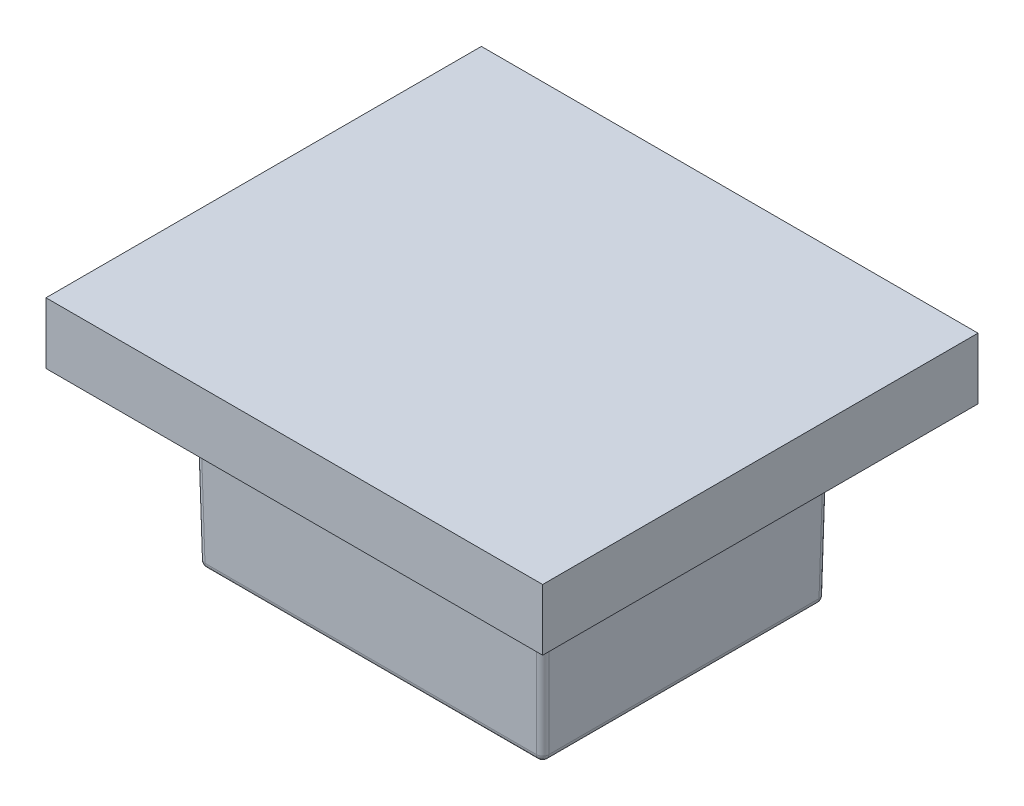
ISO-10303-21;
HEADER;
FILE_DESCRIPTION(('STEP AP214'),'2;1');
FILE_NAME('part.step','',(''),(''),'','','');
FILE_SCHEMA(('AUTOMOTIVE_DESIGN { 1 0 10303 214 1 1 1 1 }'));
ENDSEC;
DATA;
#1=APPLICATION_CONTEXT('core data for automotive mechanical design processes');
#2=APPLICATION_PROTOCOL_DEFINITION('international standard','automotive_design',2000,#1);
#3=PRODUCT_CONTEXT('',#1,'mechanical');
#4=PRODUCT('Part','Part','',(#3));
#5=PRODUCT_RELATED_PRODUCT_CATEGORY('part','',(#4));
#6=PRODUCT_DEFINITION_FORMATION('','',#4);
#7=PRODUCT_DEFINITION_CONTEXT('part definition',#1,'design');
#8=PRODUCT_DEFINITION('design','',#6,#7);
#9=PRODUCT_DEFINITION_SHAPE('','',#8);
#10=(LENGTH_UNIT() NAMED_UNIT(*) SI_UNIT(.MILLI.,.METRE.));
#11=(NAMED_UNIT(*) PLANE_ANGLE_UNIT() SI_UNIT($,.RADIAN.));
#12=(NAMED_UNIT(*) SI_UNIT($,.STERADIAN.) SOLID_ANGLE_UNIT());
#13=UNCERTAINTY_MEASURE_WITH_UNIT(LENGTH_MEASURE(1.E-05),#10,'distance_accuracy_value','');
#14=(GEOMETRIC_REPRESENTATION_CONTEXT(3) GLOBAL_UNCERTAINTY_ASSIGNED_CONTEXT((#13)) GLOBAL_UNIT_ASSIGNED_CONTEXT((#10,
#11,#12)) REPRESENTATION_CONTEXT('',''));
#15=CARTESIAN_POINT('',(0.,0.,0.));
#16=DIRECTION('',(0.,0.,1.));
#17=DIRECTION('',(1.,0.,0.));
#18=AXIS2_PLACEMENT_3D('',#15,#16,#17);
#19=CARTESIAN_POINT('',(0.,40.,0.));
#20=DIRECTION('',(0.,1.,0.));
#21=DIRECTION('',(0.,0.,1.));
#22=AXIS2_PLACEMENT_3D('',#19,#20,#21);
#23=PLANE('',#22);
#24=DIRECTION('',(0.,0.,1.));
#25=VECTOR('',#24,1.);
#26=CARTESIAN_POINT('',(70.5236519478465,40.,10.5236519478465));
#27=LINE('',#26,#25);
#28=CARTESIAN_POINT('',(70.5236519478465,40.,-60.5236519478465));
#29=VERTEX_POINT('',#28);
#30=CARTESIAN_POINT('',(70.5236519478465,40.,10.5236519478465));
#31=VERTEX_POINT('',#30);
#32=EDGE_CURVE('E225',#29,#31,#27,.T.);
#33=ORIENTED_EDGE('',*,*,#32,.F.);
#34=DIRECTION('',(1.,0.,0.));
#35=VECTOR('',#34,1.);
#36=CARTESIAN_POINT('',(70.5236519478465,40.,-60.5236519478465));
#37=LINE('',#36,#35);
#38=CARTESIAN_POINT('',(-10.5236519478465,40.,-60.5236519478465));
#39=VERTEX_POINT('',#38);
#40=EDGE_CURVE('E234',#39,#29,#37,.T.);
#41=ORIENTED_EDGE('',*,*,#40,.F.);
#42=DIRECTION('',(0.,0.,-1.));
#43=VECTOR('',#42,1.);
#44=CARTESIAN_POINT('',(-10.5236519478465,40.,10.5236519478465));
#45=LINE('',#44,#43);
#46=CARTESIAN_POINT('',(-10.5236519478465,40.,10.5236519478465));
#47=VERTEX_POINT('',#46);
#48=EDGE_CURVE('E231',#47,#39,#45,.T.);
#49=ORIENTED_EDGE('',*,*,#48,.F.);
#50=DIRECTION('',(-1.,0.,0.));
#51=VECTOR('',#50,1.);
#52=CARTESIAN_POINT('',(70.5236519478465,40.,10.5236519478465));
#53=LINE('',#52,#51);
#54=EDGE_CURVE('E228',#31,#47,#53,.T.);
#55=ORIENTED_EDGE('',*,*,#54,.F.);
#56=EDGE_LOOP('',(#33,#41,#49,#55));
#57=FACE_BOUND('',#56,.T.);
#58=ADVANCED_FACE('F41',(#57),#23,.T.);
#59=CARTESIAN_POINT('',(70.5236519478465,40.,10.5236519478465));
#60=DIRECTION('',(0.,0.,1.));
#61=DIRECTION('',(1.,0.,0.));
#62=AXIS2_PLACEMENT_3D('',#59,#60,#61);
#63=PLANE('',#62);
#64=DIRECTION('',(0.,-1.,0.));
#65=VECTOR('',#64,1.);
#66=CARTESIAN_POINT('',(-10.5236519478465,40.,10.5236519478465));
#67=LINE('',#66,#65);
#68=CARTESIAN_POINT('',(-10.5236519478465,30.,10.5236519478465));
#69=VERTEX_POINT('',#68);
#70=EDGE_CURVE('E244',#47,#69,#67,.T.);
#71=ORIENTED_EDGE('',*,*,#70,.T.);
#72=DIRECTION('',(1.,0.,0.));
#73=VECTOR('',#72,1.);
#74=CARTESIAN_POINT('',(70.5236519478465,30.,10.5236519478465));
#75=LINE('',#74,#73);
#76=CARTESIAN_POINT('',(70.5236519478465,30.,10.5236519478465));
#77=VERTEX_POINT('',#76);
#78=EDGE_CURVE('E45',#69,#77,#75,.T.);
#79=ORIENTED_EDGE('',*,*,#78,.T.);
#80=DIRECTION('',(0.,-1.,0.));
#81=VECTOR('',#80,1.);
#82=CARTESIAN_POINT('',(70.5236519478465,40.,10.5236519478465));
#83=LINE('',#82,#81);
#84=EDGE_CURVE('E237',#31,#77,#83,.T.);
#85=ORIENTED_EDGE('',*,*,#84,.F.);
#86=ORIENTED_EDGE('',*,*,#54,.T.);
#87=EDGE_LOOP('',(#71,#79,#85,#86));
#88=FACE_BOUND('',#87,.T.);
#89=ADVANCED_FACE('F261',(#88),#63,.T.);
#90=CARTESIAN_POINT('',(-10.5236519478465,40.,10.5236519478465));
#91=DIRECTION('',(-1.,0.,0.));
#92=DIRECTION('',(0.,0.,1.));
#93=AXIS2_PLACEMENT_3D('',#90,#91,#92);
#94=PLANE('',#93);
#95=DIRECTION('',(0.,-1.,0.));
#96=VECTOR('',#95,1.);
#97=CARTESIAN_POINT('',(-10.5236519478465,40.,-60.5236519478465));
#98=LINE('',#97,#96);
#99=CARTESIAN_POINT('',(-10.5236519478465,30.,-60.5236519478465));
#100=VERTEX_POINT('',#99);
#101=EDGE_CURVE('E241',#39,#100,#98,.T.);
#102=ORIENTED_EDGE('',*,*,#101,.T.);
#103=DIRECTION('',(0.,0.,1.));
#104=VECTOR('',#103,1.);
#105=CARTESIAN_POINT('',(-10.5236519478465,30.,10.5236519478465));
#106=LINE('',#105,#104);
#107=EDGE_CURVE('E215',#100,#69,#106,.T.);
#108=ORIENTED_EDGE('',*,*,#107,.T.);
#109=ORIENTED_EDGE('',*,*,#70,.F.);
#110=ORIENTED_EDGE('',*,*,#48,.T.);
#111=EDGE_LOOP('',(#102,#108,#109,#110));
#112=FACE_BOUND('',#111,.T.);
#113=ADVANCED_FACE('F268',(#112),#94,.T.);
#114=CARTESIAN_POINT('',(70.5236519478465,40.,-60.5236519478465));
#115=DIRECTION('',(0.,0.,-1.));
#116=DIRECTION('',(-1.,0.,0.));
#117=AXIS2_PLACEMENT_3D('',#114,#115,#116);
#118=PLANE('',#117);
#119=DIRECTION('',(0.,-1.,0.));
#120=VECTOR('',#119,1.);
#121=CARTESIAN_POINT('',(70.5236519478465,40.,-60.5236519478465));
#122=LINE('',#121,#120);
#123=CARTESIAN_POINT('',(70.5236519478465,30.,-60.5236519478465));
#124=VERTEX_POINT('',#123);
#125=EDGE_CURVE('E238',#29,#124,#122,.T.);
#126=ORIENTED_EDGE('',*,*,#125,.T.);
#127=DIRECTION('',(-1.,0.,0.));
#128=VECTOR('',#127,1.);
#129=CARTESIAN_POINT('',(70.5236519478465,30.,-60.5236519478465));
#130=LINE('',#129,#128);
#131=EDGE_CURVE('E219',#124,#100,#130,.T.);
#132=ORIENTED_EDGE('',*,*,#131,.T.);
#133=ORIENTED_EDGE('',*,*,#101,.F.);
#134=ORIENTED_EDGE('',*,*,#40,.T.);
#135=EDGE_LOOP('',(#126,#132,#133,#134));
#136=FACE_BOUND('',#135,.T.);
#137=ADVANCED_FACE('F276',(#136),#118,.T.);
#138=CARTESIAN_POINT('',(70.5236519478465,40.,10.5236519478465));
#139=DIRECTION('',(1.,0.,0.));
#140=DIRECTION('',(0.,0.,-1.));
#141=AXIS2_PLACEMENT_3D('',#138,#139,#140);
#142=PLANE('',#141);
#143=ORIENTED_EDGE('',*,*,#84,.T.);
#144=DIRECTION('',(0.,0.,-1.));
#145=VECTOR('',#144,1.);
#146=CARTESIAN_POINT('',(70.5236519478465,30.,10.5236519478465));
#147=LINE('',#146,#145);
#148=EDGE_CURVE('E222',#77,#124,#147,.T.);
#149=ORIENTED_EDGE('',*,*,#148,.T.);
#150=ORIENTED_EDGE('',*,*,#125,.F.);
#151=ORIENTED_EDGE('',*,*,#32,.T.);
#152=EDGE_LOOP('',(#143,#149,#150,#151));
#153=FACE_BOUND('',#152,.T.);
#154=ADVANCED_FACE('F43',(#153),#142,.T.);
#155=CARTESIAN_POINT('',(0.,0.,0.));
#156=DIRECTION('',(0.,1.,0.));
#157=DIRECTION('',(0.,0.,1.));
#158=AXIS2_PLACEMENT_3D('',#155,#156,#157);
#159=PLANE('',#158);
#160=CARTESIAN_POINT('',(7.47634805215347,0.,-7.47634805215347));
#161=DIRECTION('',(0.,1.,0.));
#162=DIRECTION('',(0.,0.,1.));
#163=AXIS2_PLACEMENT_3D('',#160,#161,#162);
#164=CIRCLE('',#163,1.46508987014356);
#165=CARTESIAN_POINT('',(7.47634805215347,0.,-6.01125818200991));
#166=VERTEX_POINT('',#165);
#167=EDGE_CURVE('E218',#166,#166,#164,.F.);
#168=ORIENTED_EDGE('',*,*,#167,.T.);
#169=EDGE_LOOP('',(#168));
#170=FACE_BOUND('',#169,.T.);
#171=ADVANCED_FACE('F398',(#170),#159,.F.);
#172=CARTESIAN_POINT('',(0.,0.0349048128745671,-1.99969539031278));
#173=DIRECTION('',(0.,-0.0174524064372835,0.999847695156391));
#174=DIRECTION('',(0.,-0.999847695156391,-0.0174524064372835));
#175=AXIS2_PLACEMENT_3D('',#172,#173,#174);
#176=PLANE('',#175);
#177=DIRECTION('',(-1.,0.,0.));
#178=VECTOR('',#177,1.);
#179=CARTESIAN_POINT('',(0.,30.,-1.47665270824129));
#180=LINE('',#179,#178);
#181=CARTESIAN_POINT('',(2.47650040339768,30.,-1.47665270824129));
#182=VERTEX_POINT('',#181);
#183=CARTESIAN_POINT('',(57.5234995966023,30.,-1.47665270824129));
#184=VERTEX_POINT('',#183);
#185=EDGE_CURVE('E198',#182,#184,#180,.F.);
#186=ORIENTED_EDGE('',*,*,#185,.F.);
#187=DIRECTION('',(0.0174497491606827,-0.999695459881887,-0.0174497491606827));
#188=VECTOR('',#187,1.);
#189=CARTESIAN_POINT('',(2.99862974335948,0.0872301472947649,-1.99878204820309));
#190=LINE('',#189,#188);
#191=CARTESIAN_POINT('',(2.94809178934707,2.98254759356272,-1.94824409419068));
#192=VERTEX_POINT('',#191);
#193=EDGE_CURVE('E208',#182,#192,#190,.T.);
#194=ORIENTED_EDGE('',*,*,#193,.T.);
#195=DIRECTION('',(1.,0.,0.));
#196=VECTOR('',#195,1.);
#197=CARTESIAN_POINT('',(0.,2.98254759356272,-1.94824409419068));
#198=LINE('',#197,#196);
#199=CARTESIAN_POINT('',(57.0519082106529,2.98254759356272,-1.94824409419068));
#200=VERTEX_POINT('',#199);
#201=EDGE_CURVE('E197',#192,#200,#198,.T.);
#202=ORIENTED_EDGE('',*,*,#201,.T.);
#203=DIRECTION('',(-0.0174497491606827,-0.999695459881887,-0.0174497491606827));
#204=VECTOR('',#203,1.);
#205=CARTESIAN_POINT('',(57.0013702566405,0.087230147294765,-1.99878204820309));
#206=LINE('',#205,#204);
#207=EDGE_CURVE('E194',#200,#184,#206,.F.);
#208=ORIENTED_EDGE('',*,*,#207,.T.);
#209=EDGE_LOOP('',(#186,#194,#202,#208));
#210=FACE_BOUND('',#209,.T.);
#211=ADVANCED_FACE('F328',(#210),#176,.T.);
#212=CARTESIAN_POINT('',(2.99862974335948,0.104682553732048,-2.99862974335948));
#213=DIRECTION('',(0.0174497491606827,-0.999695459881887,-0.0174497491606827));
#214=DIRECTION('',(0.,0.0174524064372835,-0.999847695156391));
#215=AXIS2_PLACEMENT_3D('',#212,#213,#214);
#216=CYLINDRICAL_SURFACE('',#215,1.);
#217=CARTESIAN_POINT('',(2.47680503628519,30.,-2.47680503628519));
#218=DIRECTION('',(0.,-1.,0.));
#219=DIRECTION('',(0.707106781186548,0.,-0.707106781186548));
#220=AXIS2_PLACEMENT_3D('',#217,#218,#219);
#221=ELLIPSE('',#220,1.00030463289105,1.);
#222=CARTESIAN_POINT('',(1.47665270824129,30.,-2.47650040339768));
#223=VERTEX_POINT('',#222);
#224=EDGE_CURVE('E212',#223,#182,#221,.F.);
#225=ORIENTED_EDGE('',*,*,#224,.F.);
#226=DIRECTION('',(0.0174497491606827,-0.999695459881887,-0.0174497491606827));
#227=VECTOR('',#226,1.);
#228=CARTESIAN_POINT('',(1.99878204820309,0.0872301472947649,-2.99862974335948));
#229=LINE('',#228,#227);
#230=CARTESIAN_POINT('',(1.94824409419068,2.98254759356272,-2.94809178934707));
#231=VERTEX_POINT('',#230);
#232=EDGE_CURVE('E205',#231,#223,#229,.F.);
#233=ORIENTED_EDGE('',*,*,#232,.F.);
#234=CARTESIAN_POINT('',(2.94809178934707,3.,-2.94809178934707));
#235=DIRECTION('',(0.0174497491606827,-0.999695459881887,-0.0174497491606827));
#236=DIRECTION('',(0.,0.0174524064372835,-0.999847695156391));
#237=AXIS2_PLACEMENT_3D('',#234,#235,#236);
#238=CIRCLE('',#237,1.);
#239=EDGE_CURVE('E209',#192,#231,#238,.T.);
#240=ORIENTED_EDGE('',*,*,#239,.F.);
#241=ORIENTED_EDGE('',*,*,#193,.F.);
#242=EDGE_LOOP('',(#225,#233,#240,#241));
#243=FACE_BOUND('',#242,.T.);
#244=ADVANCED_FACE('F294',(#243),#216,.T.);
#245=CARTESIAN_POINT('',(2.94809178934707,3.,-2.94809178934707));
#246=DIRECTION('',(0.,0.,1.));
#247=DIRECTION('',(1.,0.,0.));
#248=AXIS2_PLACEMENT_3D('',#245,#246,#247);
#249=SPHERICAL_SURFACE('',#248,1.);
#250=ORIENTED_EDGE('',*,*,#239,.T.);
#251=CARTESIAN_POINT('',(2.94809178934707,3.,-2.94809178934707));
#252=DIRECTION('',(0.,0.,1.));
#253=DIRECTION('',(1.,0.,0.));
#254=AXIS2_PLACEMENT_3D('',#251,#252,#253);
#255=CIRCLE('',#254,1.);
#256=CARTESIAN_POINT('',(2.94809178934707,2.,-2.94809178934707));
#257=VERTEX_POINT('',#256);
#258=EDGE_CURVE('E201',#231,#257,#255,.T.);
#259=ORIENTED_EDGE('',*,*,#258,.T.);
#260=CARTESIAN_POINT('',(2.94809178934707,3.,-2.94809178934707));
#261=DIRECTION('',(1.,0.,0.));
#262=DIRECTION('',(0.,0.,-1.));
#263=AXIS2_PLACEMENT_3D('',#260,#261,#262);
#264=CIRCLE('',#263,1.);
#265=EDGE_CURVE('E202',#192,#257,#264,.T.);
#266=ORIENTED_EDGE('',*,*,#265,.F.);
#267=EDGE_LOOP('',(#250,#259,#266));
#268=FACE_BOUND('',#267,.T.);
#269=ADVANCED_FACE('F325',(#268),#249,.T.);
#270=CARTESIAN_POINT('',(0.,3.,-2.94809178934707));
#271=DIRECTION('',(1.,0.,0.));
#272=DIRECTION('',(0.,0.,-1.));
#273=AXIS2_PLACEMENT_3D('',#270,#271,#272);
#274=CYLINDRICAL_SURFACE('',#273,1.);
#275=ORIENTED_EDGE('',*,*,#265,.T.);
#276=DIRECTION('',(1.,0.,0.));
#277=VECTOR('',#276,1.);
#278=CARTESIAN_POINT('',(0.,2.,-2.94809178934707));
#279=LINE('',#278,#277);
#280=CARTESIAN_POINT('',(57.0519082106529,2.,-2.94809178934707));
#281=VERTEX_POINT('',#280);
#282=EDGE_CURVE('E160',#281,#257,#279,.F.);
#283=ORIENTED_EDGE('',*,*,#282,.F.);
#284=CARTESIAN_POINT('',(57.0519082106529,3.,-2.94809178934707));
#285=DIRECTION('',(1.,0.,0.));
#286=DIRECTION('',(0.,0.,-1.));
#287=AXIS2_PLACEMENT_3D('',#284,#285,#286);
#288=CIRCLE('',#287,1.);
#289=EDGE_CURVE('E164',#281,#200,#288,.F.);
#290=ORIENTED_EDGE('',*,*,#289,.T.);
#291=ORIENTED_EDGE('',*,*,#201,.F.);
#292=EDGE_LOOP('',(#275,#283,#290,#291));
#293=FACE_BOUND('',#292,.T.);
#294=ADVANCED_FACE('F323',(#293),#274,.T.);
#295=CARTESIAN_POINT('',(57.0519082106529,3.,-2.94809178934707));
#296=DIRECTION('',(0.,0.,1.));
#297=DIRECTION('',(1.,0.,0.));
#298=AXIS2_PLACEMENT_3D('',#295,#296,#297);
#299=SPHERICAL_SURFACE('',#298,1.);
#300=CARTESIAN_POINT('',(57.0519082106529,3.,-2.94809178934707));
#301=DIRECTION('',(0.,0.,1.));
#302=DIRECTION('',(1.,0.,0.));
#303=AXIS2_PLACEMENT_3D('',#300,#301,#302);
#304=CIRCLE('',#303,1.);
#305=CARTESIAN_POINT('',(58.0517559058093,2.98254759356272,-2.94809178934707));
#306=VERTEX_POINT('',#305);
#307=EDGE_CURVE('E163',#281,#306,#304,.T.);
#308=ORIENTED_EDGE('',*,*,#307,.T.);
#309=CARTESIAN_POINT('',(57.0519082106529,3.,-2.94809178934707));
#310=DIRECTION('',(-0.0174497491606827,-0.999695459881887,-0.0174497491606827));
#311=DIRECTION('',(0.,0.0174524064372835,-0.999847695156391));
#312=AXIS2_PLACEMENT_3D('',#309,#310,#311);
#313=CIRCLE('',#312,1.);
#314=EDGE_CURVE('E178',#306,#200,#313,.T.);
#315=ORIENTED_EDGE('',*,*,#314,.T.);
#316=ORIENTED_EDGE('',*,*,#289,.F.);
#317=EDGE_LOOP('',(#308,#315,#316));
#318=FACE_BOUND('',#317,.T.);
#319=ADVANCED_FACE('F355',(#318),#299,.T.);
#320=CARTESIAN_POINT('',(57.0013702566405,0.104682553732048,-2.99862974335948));
#321=DIRECTION('',(-0.0174497491606827,-0.999695459881887,-0.0174497491606827));
#322=DIRECTION('',(0.,0.0174524064372835,-0.999847695156391));
#323=AXIS2_PLACEMENT_3D('',#320,#321,#322);
#324=CYLINDRICAL_SURFACE('',#323,1.);
#325=CARTESIAN_POINT('',(57.5231949637148,30.,-2.47680503628519));
#326=DIRECTION('',(0.,-1.,0.));
#327=DIRECTION('',(-0.707106781186548,0.,-0.707106781186548));
#328=AXIS2_PLACEMENT_3D('',#325,#326,#327);
#329=ELLIPSE('',#328,1.00030463289105,1.);
#330=CARTESIAN_POINT('',(58.5233472917587,30.,-2.47650040339768));
#331=VERTEX_POINT('',#330);
#332=EDGE_CURVE('E191',#184,#331,#329,.F.);
#333=ORIENTED_EDGE('',*,*,#332,.F.);
#334=ORIENTED_EDGE('',*,*,#207,.F.);
#335=ORIENTED_EDGE('',*,*,#314,.F.);
#336=DIRECTION('',(-0.0174497491606827,-0.999695459881887,-0.0174497491606827));
#337=VECTOR('',#336,1.);
#338=CARTESIAN_POINT('',(58.0012179517969,0.0872301472947649,-2.99862974335948));
#339=LINE('',#338,#337);
#340=EDGE_CURVE('E183',#331,#306,#339,.T.);
#341=ORIENTED_EDGE('',*,*,#340,.F.);
#342=EDGE_LOOP('',(#333,#334,#335,#341));
#343=FACE_BOUND('',#342,.T.);
#344=ADVANCED_FACE('F358',(#343),#324,.T.);
#345=CARTESIAN_POINT('',(58.0003046096872,0.0349048128745671,0.));
#346=DIRECTION('',(0.999847695156391,-0.0174524064372835,0.));
#347=DIRECTION('',(0.0174524064372835,0.999847695156391,0.));
#348=AXIS2_PLACEMENT_3D('',#345,#346,#347);
#349=PLANE('',#348);
#350=DIRECTION('',(0.,0.,1.));
#351=VECTOR('',#350,1.);
#352=CARTESIAN_POINT('',(58.0517559058093,2.98254759356272,0.));
#353=LINE('',#352,#351);
#354=CARTESIAN_POINT('',(58.0517559058093,2.98254759356272,-47.0519082106529));
#355=VERTEX_POINT('',#354);
#356=EDGE_CURVE('E179',#306,#355,#353,.F.);
#357=ORIENTED_EDGE('',*,*,#356,.T.);
#358=DIRECTION('',(-0.0174497491606827,-0.999695459881887,0.0174497491606827));
#359=VECTOR('',#358,1.);
#360=CARTESIAN_POINT('',(57.9829483270507,-0.959435953425973,-46.9831006318943));
#361=LINE('',#360,#359);
#362=CARTESIAN_POINT('',(58.5233472917587,30.,-47.5234995966023));
#363=VERTEX_POINT('',#362);
#364=EDGE_CURVE('E186',#355,#363,#361,.F.);
#365=ORIENTED_EDGE('',*,*,#364,.T.);
#366=DIRECTION('',(0.,0.,1.));
#367=VECTOR('',#366,1.);
#368=CARTESIAN_POINT('',(58.5233472917587,30.,0.));
#369=LINE('',#368,#367);
#370=EDGE_CURVE('E182',#331,#363,#369,.F.);
#371=ORIENTED_EDGE('',*,*,#370,.F.);
#372=ORIENTED_EDGE('',*,*,#340,.T.);
#373=EDGE_LOOP('',(#357,#365,#371,#372));
#374=FACE_BOUND('',#373,.T.);
#375=ADVANCED_FACE('F341',(#374),#349,.T.);
#376=CARTESIAN_POINT('',(56.9831006318943,-0.941983546988689,-46.9831006318943));
#377=DIRECTION('',(-0.0174497491606827,-0.999695459881887,0.0174497491606827));
#378=DIRECTION('',(0.,-0.0174524064372835,-0.999847695156391));
#379=AXIS2_PLACEMENT_3D('',#376,#377,#378);
#380=CYLINDRICAL_SURFACE('',#379,1.);
#381=CARTESIAN_POINT('',(57.5231949637148,30.,-47.5231949637148));
#382=DIRECTION('',(0.,-1.,0.));
#383=DIRECTION('',(-0.707106781186548,0.,0.707106781186548));
#384=AXIS2_PLACEMENT_3D('',#381,#382,#383);
#385=ELLIPSE('',#384,1.00030463289105,1.);
#386=CARTESIAN_POINT('',(57.5234995966023,30.,-48.5233472917587));
#387=VERTEX_POINT('',#386);
#388=EDGE_CURVE('E119',#363,#387,#385,.F.);
#389=ORIENTED_EDGE('',*,*,#388,.F.);
#390=ORIENTED_EDGE('',*,*,#364,.F.);
#391=CARTESIAN_POINT('',(57.0519082106529,3.,-47.0519082106529));
#392=DIRECTION('',(-0.0174497491606827,-0.999695459881887,0.0174497491606827));
#393=DIRECTION('',(0.,-0.0174524064372835,-0.999847695156391));
#394=AXIS2_PLACEMENT_3D('',#391,#392,#393);
#395=CIRCLE('',#394,1.);
#396=CARTESIAN_POINT('',(57.0519082106529,2.98254759356272,-48.0517559058093));
#397=VERTEX_POINT('',#396);
#398=EDGE_CURVE('E134',#397,#355,#395,.T.);
#399=ORIENTED_EDGE('',*,*,#398,.F.);
#400=DIRECTION('',(-0.0174497491606827,-0.999695459881887,0.0174497491606827));
#401=VECTOR('',#400,1.);
#402=CARTESIAN_POINT('',(56.9831006318943,-0.959435953425973,-47.9829483270507));
#403=LINE('',#402,#401);
#404=EDGE_CURVE('E132',#387,#397,#403,.T.);
#405=ORIENTED_EDGE('',*,*,#404,.F.);
#406=EDGE_LOOP('',(#389,#390,#399,#405));
#407=FACE_BOUND('',#406,.T.);
#408=ADVANCED_FACE('F345',(#407),#380,.T.);
#409=CARTESIAN_POINT('',(57.0519082106529,3.,-47.0519082106529));
#410=DIRECTION('',(0.,0.,1.));
#411=DIRECTION('',(1.,0.,0.));
#412=AXIS2_PLACEMENT_3D('',#409,#410,#411);
#413=SPHERICAL_SURFACE('',#412,1.);
#414=CARTESIAN_POINT('',(57.0519082106529,3.,-47.0519082106529));
#415=DIRECTION('',(-1.,0.,0.));
#416=DIRECTION('',(0.,-1.,0.));
#417=AXIS2_PLACEMENT_3D('',#414,#415,#416);
#418=CIRCLE('',#417,1.);
#419=CARTESIAN_POINT('',(57.0519082106529,2.,-47.0519082106529));
#420=VERTEX_POINT('',#419);
#421=EDGE_CURVE('E140',#420,#397,#418,.F.);
#422=ORIENTED_EDGE('',*,*,#421,.T.);
#423=ORIENTED_EDGE('',*,*,#398,.T.);
#424=CARTESIAN_POINT('',(57.0519082106529,3.,-47.0519082106529));
#425=DIRECTION('',(0.,0.,-1.));
#426=DIRECTION('',(-1.,0.,0.));
#427=AXIS2_PLACEMENT_3D('',#424,#425,#426);
#428=CIRCLE('',#427,1.);
#429=EDGE_CURVE('E143',#420,#355,#428,.F.);
#430=ORIENTED_EDGE('',*,*,#429,.F.);
#431=EDGE_LOOP('',(#422,#423,#430));
#432=FACE_BOUND('',#431,.T.);
#433=ADVANCED_FACE('F348',(#432),#413,.T.);
#434=CARTESIAN_POINT('',(57.0519082106529,3.,0.));
#435=DIRECTION('',(0.,0.,-1.));
#436=DIRECTION('',(-1.,0.,0.));
#437=AXIS2_PLACEMENT_3D('',#434,#435,#436);
#438=CYLINDRICAL_SURFACE('',#437,1.);
#439=ORIENTED_EDGE('',*,*,#429,.T.);
#440=ORIENTED_EDGE('',*,*,#356,.F.);
#441=ORIENTED_EDGE('',*,*,#307,.F.);
#442=DIRECTION('',(0.,0.,-1.));
#443=VECTOR('',#442,1.);
#444=CARTESIAN_POINT('',(57.0519082106529,2.,0.));
#445=LINE('',#444,#443);
#446=EDGE_CURVE('E158',#420,#281,#445,.F.);
#447=ORIENTED_EDGE('',*,*,#446,.F.);
#448=EDGE_LOOP('',(#439,#440,#441,#447));
#449=FACE_BOUND('',#448,.T.);
#450=ADVANCED_FACE('F352',(#449),#438,.T.);
#451=CARTESIAN_POINT('',(52.5236519478465,2.,-7.47634805215347));
#452=DIRECTION('',(0.,1.,0.));
#453=DIRECTION('',(0.,0.,1.));
#454=AXIS2_PLACEMENT_3D('',#451,#452,#453);
#455=CONICAL_SURFACE('',#454,1.5,0.0174532925199433);
#456=CARTESIAN_POINT('',(52.5236519478465,0.,-7.47634805215347));
#457=DIRECTION('',(0.,-1.,0.));
#458=DIRECTION('',(0.,0.,-1.));
#459=AXIS2_PLACEMENT_3D('',#456,#457,#458);
#460=CIRCLE('',#459,1.46508987014357);
#461=CARTESIAN_POINT('',(52.5236519478465,0.,-8.94143792229704));
#462=VERTEX_POINT('',#461);
#463=EDGE_CURVE('E157',#462,#462,#460,.T.);
#464=ORIENTED_EDGE('',*,*,#463,.F.);
#465=EDGE_LOOP('',(#464));
#466=FACE_BOUND('',#465,.T.);
#467=CARTESIAN_POINT('',(52.5236519478465,2.,-7.47634805215347));
#468=DIRECTION('',(0.,1.,0.));
#469=DIRECTION('',(0.,0.,1.));
#470=AXIS2_PLACEMENT_3D('',#467,#468,#469);
#471=CIRCLE('',#470,1.5);
#472=CARTESIAN_POINT('',(52.5236519478465,2.,-5.97634805215347));
#473=VERTEX_POINT('',#472);
#474=EDGE_CURVE('E154',#473,#473,#471,.T.);
#475=ORIENTED_EDGE('',*,*,#474,.F.);
#476=EDGE_LOOP('',(#475));
#477=FACE_BOUND('',#476,.T.);
#478=ADVANCED_FACE('F575',(#466,#477),#455,.T.);
#479=CARTESIAN_POINT('',(7.47634805215347,2.,-42.5236519478465));
#480=DIRECTION('',(0.,1.,0.));
#481=DIRECTION('',(0.,0.,1.));
#482=AXIS2_PLACEMENT_3D('',#479,#480,#481);
#483=CONICAL_SURFACE('',#482,1.5,0.0174532925199433);
#484=CARTESIAN_POINT('',(7.47634805215347,0.,-42.5236519478465));
#485=DIRECTION('',(0.,-1.,0.));
#486=DIRECTION('',(0.,0.,-1.));
#487=AXIS2_PLACEMENT_3D('',#484,#485,#486);
#488=CIRCLE('',#487,1.46508987014356);
#489=CARTESIAN_POINT('',(7.47634805215347,0.,-43.9887418179901));
#490=VERTEX_POINT('',#489);
#491=EDGE_CURVE('E153',#490,#490,#488,.T.);
#492=ORIENTED_EDGE('',*,*,#491,.F.);
#493=EDGE_LOOP('',(#492));
#494=FACE_BOUND('',#493,.T.);
#495=CARTESIAN_POINT('',(7.47634805215347,2.,-42.5236519478465));
#496=DIRECTION('',(0.,1.,0.));
#497=DIRECTION('',(0.,0.,1.));
#498=AXIS2_PLACEMENT_3D('',#495,#496,#497);
#499=CIRCLE('',#498,1.5);
#500=CARTESIAN_POINT('',(7.47634805215347,2.,-41.0236519478465));
#501=VERTEX_POINT('',#500);
#502=EDGE_CURVE('E150',#501,#501,#499,.T.);
#503=ORIENTED_EDGE('',*,*,#502,.F.);
#504=EDGE_LOOP('',(#503));
#505=FACE_BOUND('',#504,.T.);
#506=ADVANCED_FACE('F564',(#494,#505),#483,.T.);
#507=CARTESIAN_POINT('',(52.5236519478465,2.,-42.5236519478465));
#508=DIRECTION('',(0.,1.,0.));
#509=DIRECTION('',(0.,0.,1.));
#510=AXIS2_PLACEMENT_3D('',#507,#508,#509);
#511=CONICAL_SURFACE('',#510,1.5,0.0174532925199433);
#512=CARTESIAN_POINT('',(52.5236519478465,0.,-42.5236519478465));
#513=DIRECTION('',(0.,-1.,0.));
#514=DIRECTION('',(0.,0.,-1.));
#515=AXIS2_PLACEMENT_3D('',#512,#513,#514);
#516=CIRCLE('',#515,1.46508987014357);
#517=CARTESIAN_POINT('',(52.5236519478465,0.,-43.9887418179901));
#518=VERTEX_POINT('',#517);
#519=EDGE_CURVE('E149',#518,#518,#516,.T.);
#520=ORIENTED_EDGE('',*,*,#519,.F.);
#521=EDGE_LOOP('',(#520));
#522=FACE_BOUND('',#521,.T.);
#523=CARTESIAN_POINT('',(52.5236519478465,2.,-42.5236519478465));
#524=DIRECTION('',(0.,1.,0.));
#525=DIRECTION('',(0.,0.,1.));
#526=AXIS2_PLACEMENT_3D('',#523,#524,#525);
#527=CIRCLE('',#526,1.5);
#528=CARTESIAN_POINT('',(52.5236519478465,2.,-41.0236519478465));
#529=VERTEX_POINT('',#528);
#530=EDGE_CURVE('E146',#529,#529,#527,.T.);
#531=ORIENTED_EDGE('',*,*,#530,.F.);
#532=EDGE_LOOP('',(#531));
#533=FACE_BOUND('',#532,.T.);
#534=ADVANCED_FACE('F463',(#522,#533),#511,.T.);
#535=CARTESIAN_POINT('',(7.47634805215347,2.,-7.47634805215347));
#536=DIRECTION('',(0.,1.,0.));
#537=DIRECTION('',(0.,0.,1.));
#538=AXIS2_PLACEMENT_3D('',#535,#536,#537);
#539=CONICAL_SURFACE('',#538,1.5,0.0174532925199433);
#540=ORIENTED_EDGE('',*,*,#167,.F.);
#541=EDGE_LOOP('',(#540));
#542=FACE_BOUND('',#541,.T.);
#543=CARTESIAN_POINT('',(7.47634805215347,2.,-7.47634805215347));
#544=DIRECTION('',(0.,1.,0.));
#545=DIRECTION('',(0.,0.,1.));
#546=AXIS2_PLACEMENT_3D('',#543,#544,#545);
#547=CIRCLE('',#546,1.5);
#548=CARTESIAN_POINT('',(7.47634805215347,2.,-5.97634805215347));
#549=VERTEX_POINT('',#548);
#550=EDGE_CURVE('E139',#549,#549,#547,.T.);
#551=ORIENTED_EDGE('',*,*,#550,.F.);
#552=EDGE_LOOP('',(#551));
#553=FACE_BOUND('',#552,.T.);
#554=ADVANCED_FACE('F459',(#542,#553),#539,.T.);
#555=CARTESIAN_POINT('',(0.,2.,0.));
#556=DIRECTION('',(0.,-1.,0.));
#557=DIRECTION('',(0.,0.,-1.));
#558=AXIS2_PLACEMENT_3D('',#555,#556,#557);
#559=PLANE('',#558);
#560=ORIENTED_EDGE('',*,*,#550,.T.);
#561=EDGE_LOOP('',(#560));
#562=FACE_BOUND('',#561,.T.);
#563=ORIENTED_EDGE('',*,*,#530,.T.);
#564=EDGE_LOOP('',(#563));
#565=FACE_BOUND('',#564,.T.);
#566=ORIENTED_EDGE('',*,*,#502,.T.);
#567=EDGE_LOOP('',(#566));
#568=FACE_BOUND('',#567,.T.);
#569=ORIENTED_EDGE('',*,*,#474,.T.);
#570=EDGE_LOOP('',(#569));
#571=FACE_BOUND('',#570,.T.);
#572=ORIENTED_EDGE('',*,*,#446,.T.);
#573=ORIENTED_EDGE('',*,*,#282,.T.);
#574=DIRECTION('',(0.,0.,-1.));
#575=VECTOR('',#574,1.);
#576=CARTESIAN_POINT('',(2.94809178934707,2.,0.));
#577=LINE('',#576,#575);
#578=CARTESIAN_POINT('',(2.94809178934707,2.,-47.0519082106529));
#579=VERTEX_POINT('',#578);
#580=EDGE_CURVE('E138',#257,#579,#577,.T.);
#581=ORIENTED_EDGE('',*,*,#580,.T.);
#582=DIRECTION('',(1.,0.,0.));
#583=VECTOR('',#582,1.);
#584=CARTESIAN_POINT('',(0.,2.,-47.0519082106529));
#585=LINE('',#584,#583);
#586=EDGE_CURVE('E135',#579,#420,#585,.T.);
#587=ORIENTED_EDGE('',*,*,#586,.T.);
#588=EDGE_LOOP('',(#572,#573,#581,#587));
#589=FACE_BOUND('',#588,.T.);
#590=ADVANCED_FACE('F316',(#562,#565,#568,#571,#589),#559,.T.);
#591=CARTESIAN_POINT('',(0.,3.,-47.0519082106529));
#592=DIRECTION('',(-1.,0.,0.));
#593=DIRECTION('',(0.,0.,1.));
#594=AXIS2_PLACEMENT_3D('',#591,#592,#593);
#595=CYLINDRICAL_SURFACE('',#594,1.);
#596=CARTESIAN_POINT('',(2.94809178934707,3.,-47.0519082106529));
#597=DIRECTION('',(-1.,0.,0.));
#598=DIRECTION('',(0.,-1.,0.));
#599=AXIS2_PLACEMENT_3D('',#596,#597,#598);
#600=CIRCLE('',#599,1.);
#601=CARTESIAN_POINT('',(2.94809178934707,2.98254759356272,-48.0517559058093));
#602=VERTEX_POINT('',#601);
#603=EDGE_CURVE('E129',#602,#579,#600,.T.);
#604=ORIENTED_EDGE('',*,*,#603,.F.);
#605=DIRECTION('',(1.,0.,0.));
#606=VECTOR('',#605,1.);
#607=CARTESIAN_POINT('',(0.,2.98254759356272,-48.0517559058093));
#608=LINE('',#607,#606);
#609=EDGE_CURVE('E123',#397,#602,#608,.F.);
#610=ORIENTED_EDGE('',*,*,#609,.F.);
#611=ORIENTED_EDGE('',*,*,#421,.F.);
#612=ORIENTED_EDGE('',*,*,#586,.F.);
#613=EDGE_LOOP('',(#604,#610,#611,#612));
#614=FACE_BOUND('',#613,.T.);
#615=ADVANCED_FACE('F350',(#614),#595,.T.);
#616=CARTESIAN_POINT('',(0.,0.0349048128745671,-48.0003046096872));
#617=DIRECTION('',(0.,-0.0174524064372835,-0.999847695156391));
#618=DIRECTION('',(0.,0.999847695156391,-0.0174524064372835));
#619=AXIS2_PLACEMENT_3D('',#616,#617,#618);
#620=PLANE('',#619);
#621=ORIENTED_EDGE('',*,*,#609,.T.);
#622=DIRECTION('',(0.0174497491606827,-0.999695459881887,0.0174497491606827));
#623=VECTOR('',#622,1.);
#624=CARTESIAN_POINT('',(3.01385443064802,-0.78499160330585,-47.9859932645084));
#625=LINE('',#624,#623);
#626=CARTESIAN_POINT('',(2.47650040339768,30.,-48.5233472917587));
#627=VERTEX_POINT('',#626);
#628=EDGE_CURVE('E109',#602,#627,#625,.F.);
#629=ORIENTED_EDGE('',*,*,#628,.T.);
#630=DIRECTION('',(1.,0.,0.));
#631=VECTOR('',#630,1.);
#632=CARTESIAN_POINT('',(0.,30.,-48.5233472917587));
#633=LINE('',#632,#631);
#634=EDGE_CURVE('E115',#387,#627,#633,.F.);
#635=ORIENTED_EDGE('',*,*,#634,.F.);
#636=ORIENTED_EDGE('',*,*,#404,.T.);
#637=EDGE_LOOP('',(#621,#629,#635,#636));
#638=FACE_BOUND('',#637,.T.);
#639=ADVANCED_FACE('F125',(#638),#620,.T.);
#640=CARTESIAN_POINT('',(3.01385443064802,-0.767539196868566,-46.986145569352));
#641=DIRECTION('',(0.0174497491606827,-0.999695459881887,0.0174497491606827));
#642=DIRECTION('',(0.,-0.0174524064372835,-0.999847695156391));
#643=AXIS2_PLACEMENT_3D('',#640,#641,#642);
#644=CYLINDRICAL_SURFACE('',#643,1.);
#645=CARTESIAN_POINT('',(2.47680503628519,30.,-47.5231949637148));
#646=DIRECTION('',(0.,-1.,0.));
#647=DIRECTION('',(0.707106781186548,0.,0.707106781186548));
#648=AXIS2_PLACEMENT_3D('',#645,#646,#647);
#649=ELLIPSE('',#648,1.00030463289105,1.);
#650=CARTESIAN_POINT('',(1.47665270824129,30.,-47.5234995966023));
#651=VERTEX_POINT('',#650);
#652=EDGE_CURVE('E104',#627,#651,#649,.F.);
#653=ORIENTED_EDGE('',*,*,#652,.F.);
#654=ORIENTED_EDGE('',*,*,#628,.F.);
#655=CARTESIAN_POINT('',(2.94809178934707,3.,-47.0519082106529));
#656=DIRECTION('',(0.0174497491606827,-0.999695459881887,0.0174497491606827));
#657=DIRECTION('',(0.,-0.0174524064372835,-0.999847695156391));
#658=AXIS2_PLACEMENT_3D('',#655,#656,#657);
#659=CIRCLE('',#658,1.);
#660=CARTESIAN_POINT('',(1.94824409419068,2.98254759356272,-47.0519082106529));
#661=VERTEX_POINT('',#660);
#662=EDGE_CURVE('E304',#661,#602,#659,.T.);
#663=ORIENTED_EDGE('',*,*,#662,.F.);
#664=DIRECTION('',(0.0174497491606827,-0.999695459881887,0.0174497491606827));
#665=VECTOR('',#664,1.);
#666=CARTESIAN_POINT('',(2.01400673549162,-0.78499160330585,-46.986145569352));
#667=LINE('',#666,#665);
#668=EDGE_CURVE('E111',#651,#661,#667,.T.);
#669=ORIENTED_EDGE('',*,*,#668,.F.);
#670=EDGE_LOOP('',(#653,#654,#663,#669));
#671=FACE_BOUND('',#670,.T.);
#672=ADVANCED_FACE('F106',(#671),#644,.T.);
#673=CARTESIAN_POINT('',(2.94809178934707,3.,-47.0519082106529));
#674=DIRECTION('',(0.,0.,1.));
#675=DIRECTION('',(1.,0.,0.));
#676=AXIS2_PLACEMENT_3D('',#673,#674,#675);
#677=SPHERICAL_SURFACE('',#676,1.);
#678=ORIENTED_EDGE('',*,*,#662,.T.);
#679=ORIENTED_EDGE('',*,*,#603,.T.);
#680=CARTESIAN_POINT('',(2.94809178934707,3.,-47.0519082106529));
#681=DIRECTION('',(0.,0.,1.));
#682=DIRECTION('',(1.,0.,0.));
#683=AXIS2_PLACEMENT_3D('',#680,#681,#682);
#684=CIRCLE('',#683,1.);
#685=EDGE_CURVE('E302',#661,#579,#684,.T.);
#686=ORIENTED_EDGE('',*,*,#685,.F.);
#687=EDGE_LOOP('',(#678,#679,#686));
#688=FACE_BOUND('',#687,.T.);
#689=ADVANCED_FACE('F311',(#688),#677,.T.);
#690=CARTESIAN_POINT('',(2.94809178934707,3.,0.));
#691=DIRECTION('',(0.,0.,1.));
#692=DIRECTION('',(1.,0.,0.));
#693=AXIS2_PLACEMENT_3D('',#690,#691,#692);
#694=CYLINDRICAL_SURFACE('',#693,1.);
#695=ORIENTED_EDGE('',*,*,#685,.T.);
#696=ORIENTED_EDGE('',*,*,#580,.F.);
#697=ORIENTED_EDGE('',*,*,#258,.F.);
#698=DIRECTION('',(0.,0.,1.));
#699=VECTOR('',#698,1.);
#700=CARTESIAN_POINT('',(1.94824409419068,2.98254759356272,0.));
#701=LINE('',#700,#699);
#702=EDGE_CURVE('E51',#661,#231,#701,.T.);
#703=ORIENTED_EDGE('',*,*,#702,.F.);
#704=EDGE_LOOP('',(#695,#696,#697,#703));
#705=FACE_BOUND('',#704,.T.);
#706=ADVANCED_FACE('F314',(#705),#694,.T.);
#707=CARTESIAN_POINT('',(1.99969539031278,0.0349048128745671,0.));
#708=DIRECTION('',(-0.999847695156391,-0.0174524064372835,0.));
#709=DIRECTION('',(0.0174524064372835,-0.999847695156391,0.));
#710=AXIS2_PLACEMENT_3D('',#707,#708,#709);
#711=PLANE('',#710);
#712=ORIENTED_EDGE('',*,*,#702,.T.);
#713=ORIENTED_EDGE('',*,*,#232,.T.);
#714=DIRECTION('',(0.,0.,-1.));
#715=VECTOR('',#714,1.);
#716=CARTESIAN_POINT('',(1.47665270824129,30.,0.));
#717=LINE('',#716,#715);
#718=EDGE_CURVE('E11',#651,#223,#717,.F.);
#719=ORIENTED_EDGE('',*,*,#718,.F.);
#720=ORIENTED_EDGE('',*,*,#668,.T.);
#721=EDGE_LOOP('',(#712,#713,#719,#720));
#722=FACE_BOUND('',#721,.T.);
#723=ADVANCED_FACE('F297',(#722),#711,.T.);
#724=CARTESIAN_POINT('',(0.,30.,0.));
#725=DIRECTION('',(0.,-1.,0.));
#726=DIRECTION('',(0.,0.,-1.));
#727=AXIS2_PLACEMENT_3D('',#724,#725,#726);
#728=PLANE('',#727);
#729=ORIENTED_EDGE('',*,*,#718,.T.);
#730=ORIENTED_EDGE('',*,*,#224,.T.);
#731=ORIENTED_EDGE('',*,*,#185,.T.);
#732=ORIENTED_EDGE('',*,*,#332,.T.);
#733=ORIENTED_EDGE('',*,*,#370,.T.);
#734=ORIENTED_EDGE('',*,*,#388,.T.);
#735=ORIENTED_EDGE('',*,*,#634,.T.);
#736=ORIENTED_EDGE('',*,*,#652,.T.);
#737=EDGE_LOOP('',(#729,#730,#731,#732,#733,#734,#735,#736));
#738=FACE_BOUND('',#737,.T.);
#739=ORIENTED_EDGE('',*,*,#78,.F.);
#740=ORIENTED_EDGE('',*,*,#107,.F.);
#741=ORIENTED_EDGE('',*,*,#131,.F.);
#742=ORIENTED_EDGE('',*,*,#148,.F.);
#743=EDGE_LOOP('',(#739,#740,#741,#742));
#744=FACE_BOUND('',#743,.T.);
#745=ADVANCED_FACE('F116',(#738,#744),#728,.T.);
#746=CARTESIAN_POINT('',(0.,0.,0.));
#747=DIRECTION('',(0.,1.,0.));
#748=DIRECTION('',(0.,0.,1.));
#749=AXIS2_PLACEMENT_3D('',#746,#747,#748);
#750=PLANE('',#749);
#751=ORIENTED_EDGE('',*,*,#463,.T.);
#752=EDGE_LOOP('',(#751));
#753=FACE_BOUND('',#752,.T.);
#754=ADVANCED_FACE('F414',(#753),#750,.F.);
#755=CARTESIAN_POINT('',(0.,0.,0.));
#756=DIRECTION('',(0.,1.,0.));
#757=DIRECTION('',(0.,0.,1.));
#758=AXIS2_PLACEMENT_3D('',#755,#756,#757);
#759=PLANE('',#758);
#760=ORIENTED_EDGE('',*,*,#491,.T.);
#761=EDGE_LOOP('',(#760));
#762=FACE_BOUND('',#761,.T.);
#763=ADVANCED_FACE('F422',(#762),#759,.F.);
#764=CARTESIAN_POINT('',(0.,0.,0.));
#765=DIRECTION('',(0.,1.,0.));
#766=DIRECTION('',(0.,0.,1.));
#767=AXIS2_PLACEMENT_3D('',#764,#765,#766);
#768=PLANE('',#767);
#769=ORIENTED_EDGE('',*,*,#519,.T.);
#770=EDGE_LOOP('',(#769));
#771=FACE_BOUND('',#770,.T.);
#772=ADVANCED_FACE('F377',(#771),#768,.F.);
#773=CLOSED_SHELL('',(#58,#89,#113,#137,#154,#171,#211,#244,#269,#294,#319,#344,#375,#408,#433,
#450,#478,#506,#534,#554,#590,#615,#639,#672,#689,#706,#723,#745,#754,#763,#772));
#774=MANIFOLD_SOLID_BREP('B2',#773);
#775=ADVANCED_BREP_SHAPE_REPRESENTATION('',(#18,#774),#14);
#776=SHAPE_DEFINITION_REPRESENTATION(#9,#775);
ENDSEC;
END-ISO-10303-21;
